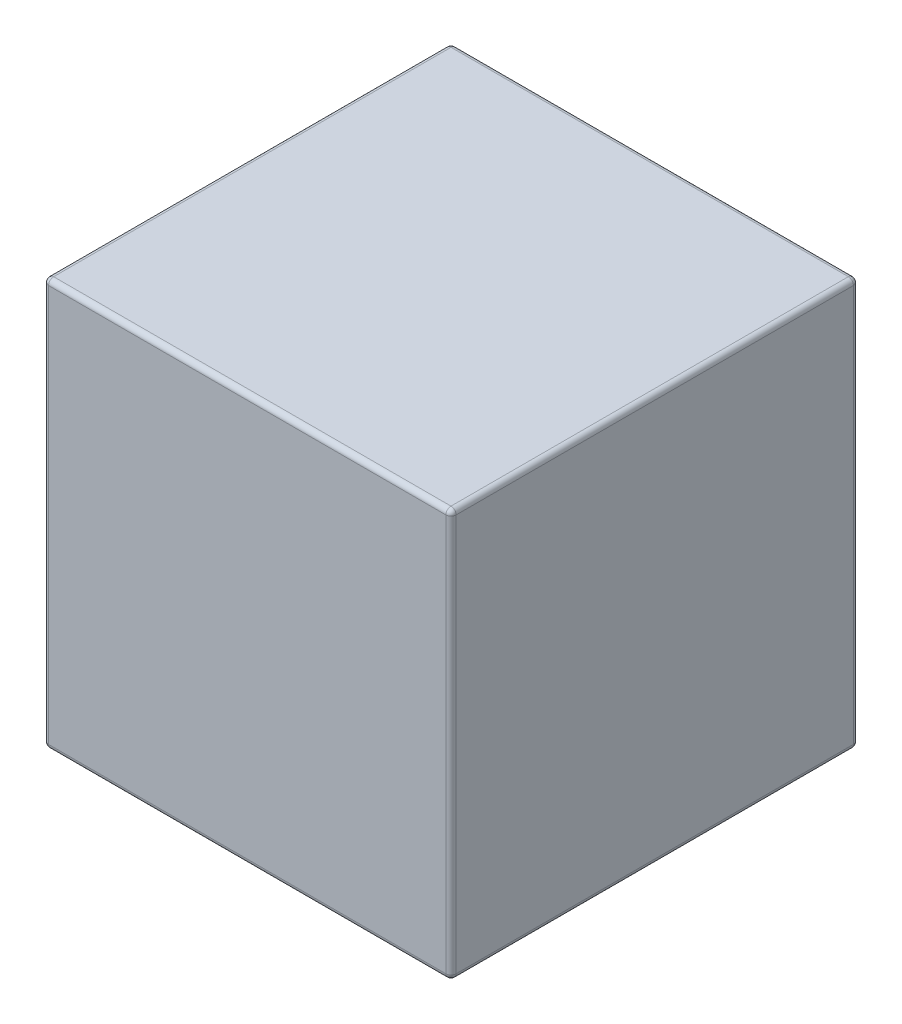
ISO-10303-21;
HEADER;
FILE_DESCRIPTION(('STEP AP214'),'2;1');
FILE_NAME('part.step','',(''),(''),'','','');
FILE_SCHEMA(('AUTOMOTIVE_DESIGN { 1 0 10303 214 1 1 1 1 }'));
ENDSEC;
DATA;
#1=APPLICATION_CONTEXT('core data for automotive mechanical design processes');
#2=APPLICATION_PROTOCOL_DEFINITION('international standard','automotive_design',2000,#1);
#3=PRODUCT_CONTEXT('',#1,'mechanical');
#4=PRODUCT('Part','Part','',(#3));
#5=PRODUCT_RELATED_PRODUCT_CATEGORY('part','',(#4));
#6=PRODUCT_DEFINITION_FORMATION('','',#4);
#7=PRODUCT_DEFINITION_CONTEXT('part definition',#1,'design');
#8=PRODUCT_DEFINITION('design','',#6,#7);
#9=PRODUCT_DEFINITION_SHAPE('','',#8);
#10=(LENGTH_UNIT() NAMED_UNIT(*) SI_UNIT(.MILLI.,.METRE.));
#11=(NAMED_UNIT(*) PLANE_ANGLE_UNIT() SI_UNIT($,.RADIAN.));
#12=(NAMED_UNIT(*) SI_UNIT($,.STERADIAN.) SOLID_ANGLE_UNIT());
#13=UNCERTAINTY_MEASURE_WITH_UNIT(LENGTH_MEASURE(1.E-05),#10,'distance_accuracy_value','');
#14=(GEOMETRIC_REPRESENTATION_CONTEXT(3) GLOBAL_UNCERTAINTY_ASSIGNED_CONTEXT((#13)) GLOBAL_UNIT_ASSIGNED_CONTEXT((#10,
#11,#12)) REPRESENTATION_CONTEXT('',''));
#15=CARTESIAN_POINT('',(0.,0.,0.));
#16=DIRECTION('',(0.,0.,1.));
#17=DIRECTION('',(1.,0.,0.));
#18=AXIS2_PLACEMENT_3D('',#15,#16,#17);
#19=CARTESIAN_POINT('',(25.4,50.8,25.4));
#20=DIRECTION('',(-1.,0.,0.));
#21=DIRECTION('',(0.,0.,1.));
#22=AXIS2_PLACEMENT_3D('',#19,#20,#21);
#23=PLANE('',#22);
#24=DIRECTION('',(0.,0.,-1.));
#25=VECTOR('',#24,1.);
#26=CARTESIAN_POINT('',(25.4,0.634999999999997,-25.4));
#27=LINE('',#26,#25);
#28=CARTESIAN_POINT('',(25.4,0.634999999999997,24.765));
#29=VERTEX_POINT('',#28);
#30=CARTESIAN_POINT('',(25.4,0.634999999999997,-24.765));
#31=VERTEX_POINT('',#30);
#32=EDGE_CURVE('E335',#29,#31,#27,.T.);
#33=ORIENTED_EDGE('',*,*,#32,.T.);
#34=DIRECTION('',(0.,-1.,0.));
#35=VECTOR('',#34,1.);
#36=CARTESIAN_POINT('',(25.4,50.8,-24.765));
#37=LINE('',#36,#35);
#38=CARTESIAN_POINT('',(25.4,50.165,-24.765));
#39=VERTEX_POINT('',#38);
#40=EDGE_CURVE('E255',#31,#39,#37,.F.);
#41=ORIENTED_EDGE('',*,*,#40,.T.);
#42=DIRECTION('',(0.,0.,-1.));
#43=VECTOR('',#42,1.);
#44=CARTESIAN_POINT('',(25.4,50.165,25.4));
#45=LINE('',#44,#43);
#46=CARTESIAN_POINT('',(25.4,50.165,24.765));
#47=VERTEX_POINT('',#46);
#48=EDGE_CURVE('E242',#39,#47,#45,.F.);
#49=ORIENTED_EDGE('',*,*,#48,.T.);
#50=DIRECTION('',(0.,-1.,0.));
#51=VECTOR('',#50,1.);
#52=CARTESIAN_POINT('',(25.4,50.8,24.765));
#53=LINE('',#52,#51);
#54=EDGE_CURVE('E330',#47,#29,#53,.T.);
#55=ORIENTED_EDGE('',*,*,#54,.T.);
#56=EDGE_LOOP('',(#33,#41,#49,#55));
#57=FACE_BOUND('',#56,.T.);
#58=ADVANCED_FACE('F44',(#57),#23,.F.);
#59=CARTESIAN_POINT('',(-25.4,50.8,-25.4));
#60=DIRECTION('',(0.,0.,1.));
#61=DIRECTION('',(1.,0.,0.));
#62=AXIS2_PLACEMENT_3D('',#59,#60,#61);
#63=PLANE('',#62);
#64=DIRECTION('',(-1.,0.,0.));
#65=VECTOR('',#64,1.);
#66=CARTESIAN_POINT('',(-25.4,0.634999999999997,-25.4));
#67=LINE('',#66,#65);
#68=CARTESIAN_POINT('',(24.765,0.634999999999997,-25.4));
#69=VERTEX_POINT('',#68);
#70=CARTESIAN_POINT('',(-24.765,0.634999999999997,-25.4));
#71=VERTEX_POINT('',#70);
#72=EDGE_CURVE('E308',#69,#71,#67,.T.);
#73=ORIENTED_EDGE('',*,*,#72,.T.);
#74=DIRECTION('',(0.,-1.,0.));
#75=VECTOR('',#74,1.);
#76=CARTESIAN_POINT('',(-24.765,50.8,-25.4));
#77=LINE('',#76,#75);
#78=CARTESIAN_POINT('',(-24.765,50.165,-25.4));
#79=VERTEX_POINT('',#78);
#80=EDGE_CURVE('E305',#71,#79,#77,.F.);
#81=ORIENTED_EDGE('',*,*,#80,.T.);
#82=DIRECTION('',(-1.,0.,0.));
#83=VECTOR('',#82,1.);
#84=CARTESIAN_POINT('',(-25.4,50.165,-25.4));
#85=LINE('',#84,#83);
#86=CARTESIAN_POINT('',(24.765,50.165,-25.4));
#87=VERTEX_POINT('',#86);
#88=EDGE_CURVE('E296',#79,#87,#85,.F.);
#89=ORIENTED_EDGE('',*,*,#88,.T.);
#90=DIRECTION('',(0.,-1.,0.));
#91=VECTOR('',#90,1.);
#92=CARTESIAN_POINT('',(24.765,50.8,-25.4));
#93=LINE('',#92,#91);
#94=EDGE_CURVE('E302',#87,#69,#93,.T.);
#95=ORIENTED_EDGE('',*,*,#94,.T.);
#96=EDGE_LOOP('',(#73,#81,#89,#95));
#97=FACE_BOUND('',#96,.T.);
#98=ADVANCED_FACE('F306',(#97),#63,.F.);
#99=CARTESIAN_POINT('',(-25.4,50.8,25.4));
#100=DIRECTION('',(1.,0.,0.));
#101=DIRECTION('',(0.,0.,-1.));
#102=AXIS2_PLACEMENT_3D('',#99,#100,#101);
#103=PLANE('',#102);
#104=DIRECTION('',(0.,0.,1.));
#105=VECTOR('',#104,1.);
#106=CARTESIAN_POINT('',(-25.4,50.165,25.4));
#107=LINE('',#106,#105);
#108=CARTESIAN_POINT('',(-25.4,50.165,24.765));
#109=VERTEX_POINT('',#108);
#110=CARTESIAN_POINT('',(-25.4,50.165,-24.765));
#111=VERTEX_POINT('',#110);
#112=EDGE_CURVE('E145',#109,#111,#107,.F.);
#113=ORIENTED_EDGE('',*,*,#112,.T.);
#114=DIRECTION('',(0.,-1.,0.));
#115=VECTOR('',#114,1.);
#116=CARTESIAN_POINT('',(-25.4,50.8,-24.765));
#117=LINE('',#116,#115);
#118=CARTESIAN_POINT('',(-25.4,0.634999999999997,-24.765));
#119=VERTEX_POINT('',#118);
#120=EDGE_CURVE('E140',#111,#119,#117,.T.);
#121=ORIENTED_EDGE('',*,*,#120,.T.);
#122=DIRECTION('',(0.,0.,1.));
#123=VECTOR('',#122,1.);
#124=CARTESIAN_POINT('',(-25.4,0.634999999999997,25.4));
#125=LINE('',#124,#123);
#126=CARTESIAN_POINT('',(-25.4,0.634999999999997,24.765));
#127=VERTEX_POINT('',#126);
#128=EDGE_CURVE('E134',#119,#127,#125,.T.);
#129=ORIENTED_EDGE('',*,*,#128,.T.);
#130=DIRECTION('',(0.,-1.,0.));
#131=VECTOR('',#130,1.);
#132=CARTESIAN_POINT('',(-25.4,50.8,24.765));
#133=LINE('',#132,#131);
#134=EDGE_CURVE('E137',#127,#109,#133,.F.);
#135=ORIENTED_EDGE('',*,*,#134,.T.);
#136=EDGE_LOOP('',(#113,#121,#129,#135));
#137=FACE_BOUND('',#136,.T.);
#138=ADVANCED_FACE('F136',(#137),#103,.F.);
#139=CARTESIAN_POINT('',(-25.4,50.8,25.4));
#140=DIRECTION('',(0.,0.,-1.));
#141=DIRECTION('',(-1.,0.,0.));
#142=AXIS2_PLACEMENT_3D('',#139,#140,#141);
#143=PLANE('',#142);
#144=DIRECTION('',(1.,0.,0.));
#145=VECTOR('',#144,1.);
#146=CARTESIAN_POINT('',(-25.4,50.165,25.4));
#147=LINE('',#146,#145);
#148=CARTESIAN_POINT('',(24.765,50.165,25.4));
#149=VERTEX_POINT('',#148);
#150=CARTESIAN_POINT('',(-24.765,50.165,25.4));
#151=VERTEX_POINT('',#150);
#152=EDGE_CURVE('E54',#149,#151,#147,.F.);
#153=ORIENTED_EDGE('',*,*,#152,.T.);
#154=DIRECTION('',(0.,-1.,0.));
#155=VECTOR('',#154,1.);
#156=CARTESIAN_POINT('',(-24.765,50.8,25.4));
#157=LINE('',#156,#155);
#158=CARTESIAN_POINT('',(-24.765,0.634999999999997,25.4));
#159=VERTEX_POINT('',#158);
#160=EDGE_CURVE('E11',#151,#159,#157,.T.);
#161=ORIENTED_EDGE('',*,*,#160,.T.);
#162=DIRECTION('',(1.,0.,0.));
#163=VECTOR('',#162,1.);
#164=CARTESIAN_POINT('',(25.4,0.634999999999997,25.4));
#165=LINE('',#164,#163);
#166=CARTESIAN_POINT('',(24.765,0.634999999999997,25.4));
#167=VERTEX_POINT('',#166);
#168=EDGE_CURVE('E262',#159,#167,#165,.T.);
#169=ORIENTED_EDGE('',*,*,#168,.T.);
#170=DIRECTION('',(0.,-1.,0.));
#171=VECTOR('',#170,1.);
#172=CARTESIAN_POINT('',(24.765,50.8,25.4));
#173=LINE('',#172,#171);
#174=EDGE_CURVE('E65',#167,#149,#173,.F.);
#175=ORIENTED_EDGE('',*,*,#174,.T.);
#176=EDGE_LOOP('',(#153,#161,#169,#175));
#177=FACE_BOUND('',#176,.T.);
#178=ADVANCED_FACE('F441',(#177),#143,.F.);
#179=CARTESIAN_POINT('',(0.,50.8,0.));
#180=DIRECTION('',(0.,-1.,0.));
#181=DIRECTION('',(0.,0.,-1.));
#182=AXIS2_PLACEMENT_3D('',#179,#180,#181);
#183=PLANE('',#182);
#184=DIRECTION('',(-1.,0.,0.));
#185=VECTOR('',#184,1.);
#186=CARTESIAN_POINT('',(0.,50.8,-24.765));
#187=LINE('',#186,#185);
#188=CARTESIAN_POINT('',(24.765,50.8,-24.765));
#189=VERTEX_POINT('',#188);
#190=CARTESIAN_POINT('',(-24.765,50.8,-24.765));
#191=VERTEX_POINT('',#190);
#192=EDGE_CURVE('E248',#189,#191,#187,.T.);
#193=ORIENTED_EDGE('',*,*,#192,.T.);
#194=DIRECTION('',(0.,0.,1.));
#195=VECTOR('',#194,1.);
#196=CARTESIAN_POINT('',(-24.765,50.8,0.));
#197=LINE('',#196,#195);
#198=CARTESIAN_POINT('',(-24.765,50.8,24.765));
#199=VERTEX_POINT('',#198);
#200=EDGE_CURVE('E253',#191,#199,#197,.T.);
#201=ORIENTED_EDGE('',*,*,#200,.T.);
#202=DIRECTION('',(1.,0.,0.));
#203=VECTOR('',#202,1.);
#204=CARTESIAN_POINT('',(0.,50.8,24.765));
#205=LINE('',#204,#203);
#206=CARTESIAN_POINT('',(24.765,50.8,24.765));
#207=VERTEX_POINT('',#206);
#208=EDGE_CURVE('E249',#199,#207,#205,.T.);
#209=ORIENTED_EDGE('',*,*,#208,.T.);
#210=DIRECTION('',(0.,0.,-1.));
#211=VECTOR('',#210,1.);
#212=CARTESIAN_POINT('',(24.765,50.8,0.));
#213=LINE('',#212,#211);
#214=EDGE_CURVE('E244',#207,#189,#213,.T.);
#215=ORIENTED_EDGE('',*,*,#214,.T.);
#216=EDGE_LOOP('',(#193,#201,#209,#215));
#217=FACE_BOUND('',#216,.T.);
#218=ADVANCED_FACE('F365',(#217),#183,.F.);
#219=CARTESIAN_POINT('',(0.,0.,0.));
#220=DIRECTION('',(0.,-1.,0.));
#221=DIRECTION('',(0.,0.,-1.));
#222=AXIS2_PLACEMENT_3D('',#219,#220,#221);
#223=PLANE('',#222);
#224=DIRECTION('',(0.,0.,1.));
#225=VECTOR('',#224,1.);
#226=CARTESIAN_POINT('',(-24.765,0.,-25.4));
#227=LINE('',#226,#225);
#228=CARTESIAN_POINT('',(-24.765,0.,24.765));
#229=VERTEX_POINT('',#228);
#230=CARTESIAN_POINT('',(-24.765,0.,-24.765));
#231=VERTEX_POINT('',#230);
#232=EDGE_CURVE('E168',#229,#231,#227,.F.);
#233=ORIENTED_EDGE('',*,*,#232,.T.);
#234=DIRECTION('',(-1.,0.,0.));
#235=VECTOR('',#234,1.);
#236=CARTESIAN_POINT('',(25.4,0.,-24.765));
#237=LINE('',#236,#235);
#238=CARTESIAN_POINT('',(24.765,0.,-24.765));
#239=VERTEX_POINT('',#238);
#240=EDGE_CURVE('E326',#231,#239,#237,.F.);
#241=ORIENTED_EDGE('',*,*,#240,.T.);
#242=DIRECTION('',(0.,0.,-1.));
#243=VECTOR('',#242,1.);
#244=CARTESIAN_POINT('',(24.765,0.,25.4));
#245=LINE('',#244,#243);
#246=CARTESIAN_POINT('',(24.765,0.,24.765));
#247=VERTEX_POINT('',#246);
#248=EDGE_CURVE('E317',#239,#247,#245,.F.);
#249=ORIENTED_EDGE('',*,*,#248,.T.);
#250=DIRECTION('',(1.,0.,0.));
#251=VECTOR('',#250,1.);
#252=CARTESIAN_POINT('',(-25.4,0.,24.765));
#253=LINE('',#252,#251);
#254=EDGE_CURVE('E313',#247,#229,#253,.F.);
#255=ORIENTED_EDGE('',*,*,#254,.T.);
#256=EDGE_LOOP('',(#233,#241,#249,#255));
#257=FACE_BOUND('',#256,.T.);
#258=ADVANCED_FACE('F432',(#257),#223,.T.);
#259=CARTESIAN_POINT('',(24.765,50.8,24.765));
#260=DIRECTION('',(0.,-1.,0.));
#261=DIRECTION('',(0.,0.,-1.));
#262=AXIS2_PLACEMENT_3D('',#259,#260,#261);
#263=CYLINDRICAL_SURFACE('',#262,0.635);
#264=CARTESIAN_POINT('',(24.765,50.165,24.765));
#265=DIRECTION('',(0.,1.,0.));
#266=DIRECTION('',(0.,0.,1.));
#267=AXIS2_PLACEMENT_3D('',#264,#265,#266);
#268=CIRCLE('',#267,0.635);
#269=EDGE_CURVE('E48',#149,#47,#268,.T.);
#270=ORIENTED_EDGE('',*,*,#269,.F.);
#271=ORIENTED_EDGE('',*,*,#174,.F.);
#272=CARTESIAN_POINT('',(24.765,0.634999999999997,24.765));
#273=DIRECTION('',(0.,-1.,0.));
#274=DIRECTION('',(0.,0.,-1.));
#275=AXIS2_PLACEMENT_3D('',#272,#273,#274);
#276=CIRCLE('',#275,0.635);
#277=EDGE_CURVE('E222',#29,#167,#276,.T.);
#278=ORIENTED_EDGE('',*,*,#277,.F.);
#279=ORIENTED_EDGE('',*,*,#54,.F.);
#280=EDGE_LOOP('',(#270,#271,#278,#279));
#281=FACE_BOUND('',#280,.T.);
#282=ADVANCED_FACE('F46',(#281),#263,.T.);
#283=CARTESIAN_POINT('',(24.765,50.165,24.765));
#284=DIRECTION('',(1.,0.,0.));
#285=DIRECTION('',(0.,0.,-1.));
#286=AXIS2_PLACEMENT_3D('',#283,#284,#285);
#287=SPHERICAL_SURFACE('',#286,0.635);
#288=CARTESIAN_POINT('',(24.765,50.165,24.765));
#289=DIRECTION('',(1.,0.,0.));
#290=DIRECTION('',(0.,0.,-1.));
#291=AXIS2_PLACEMENT_3D('',#288,#289,#290);
#292=CIRCLE('',#291,0.635);
#293=EDGE_CURVE('E215',#149,#207,#292,.F.);
#294=ORIENTED_EDGE('',*,*,#293,.F.);
#295=ORIENTED_EDGE('',*,*,#269,.T.);
#296=CARTESIAN_POINT('',(24.765,50.165,24.765));
#297=DIRECTION('',(0.,0.,1.));
#298=DIRECTION('',(1.,0.,0.));
#299=AXIS2_PLACEMENT_3D('',#296,#297,#298);
#300=CIRCLE('',#299,0.635);
#301=EDGE_CURVE('E219',#207,#47,#300,.F.);
#302=ORIENTED_EDGE('',*,*,#301,.F.);
#303=EDGE_LOOP('',(#294,#295,#302));
#304=FACE_BOUND('',#303,.T.);
#305=ADVANCED_FACE('F234',(#304),#287,.T.);
#306=CARTESIAN_POINT('',(24.765,0.635,24.765));
#307=DIRECTION('',(0.,0.,1.));
#308=DIRECTION('',(0.,-1.,0.));
#309=AXIS2_PLACEMENT_3D('',#306,#307,#308);
#310=SPHERICAL_SURFACE('',#309,0.635);
#311=CARTESIAN_POINT('',(24.765,0.635,24.765));
#312=DIRECTION('',(0.,0.,1.));
#313=DIRECTION('',(1.,0.,0.));
#314=AXIS2_PLACEMENT_3D('',#311,#312,#313);
#315=CIRCLE('',#314,0.635);
#316=EDGE_CURVE('E207',#29,#247,#315,.F.);
#317=ORIENTED_EDGE('',*,*,#316,.F.);
#318=ORIENTED_EDGE('',*,*,#277,.T.);
#319=CARTESIAN_POINT('',(24.765,0.634999999999997,24.765));
#320=DIRECTION('',(1.,0.,0.));
#321=DIRECTION('',(0.,0.,-1.));
#322=AXIS2_PLACEMENT_3D('',#319,#320,#321);
#323=CIRCLE('',#322,0.635);
#324=EDGE_CURVE('E211',#247,#167,#323,.F.);
#325=ORIENTED_EDGE('',*,*,#324,.F.);
#326=EDGE_LOOP('',(#317,#318,#325));
#327=FACE_BOUND('',#326,.T.);
#328=ADVANCED_FACE('F383',(#327),#310,.T.);
#329=CARTESIAN_POINT('',(24.765,50.165,0.));
#330=DIRECTION('',(0.,0.,-1.));
#331=DIRECTION('',(-1.,0.,0.));
#332=AXIS2_PLACEMENT_3D('',#329,#330,#331);
#333=CYLINDRICAL_SURFACE('',#332,0.635);
#334=ORIENTED_EDGE('',*,*,#301,.T.);
#335=ORIENTED_EDGE('',*,*,#48,.F.);
#336=CARTESIAN_POINT('',(24.765,50.165,-24.765));
#337=DIRECTION('',(0.,0.,-1.));
#338=DIRECTION('',(-1.,0.,0.));
#339=AXIS2_PLACEMENT_3D('',#336,#337,#338);
#340=CIRCLE('',#339,0.635);
#341=EDGE_CURVE('E200',#189,#39,#340,.T.);
#342=ORIENTED_EDGE('',*,*,#341,.F.);
#343=ORIENTED_EDGE('',*,*,#214,.F.);
#344=EDGE_LOOP('',(#334,#335,#342,#343));
#345=FACE_BOUND('',#344,.T.);
#346=ADVANCED_FACE('F240',(#345),#333,.T.);
#347=CARTESIAN_POINT('',(0.,50.165,24.765));
#348=DIRECTION('',(1.,0.,0.));
#349=DIRECTION('',(0.,0.,-1.));
#350=AXIS2_PLACEMENT_3D('',#347,#348,#349);
#351=CYLINDRICAL_SURFACE('',#350,0.635);
#352=ORIENTED_EDGE('',*,*,#293,.T.);
#353=ORIENTED_EDGE('',*,*,#208,.F.);
#354=CARTESIAN_POINT('',(-24.765,50.165,24.765));
#355=DIRECTION('',(-1.,0.,0.));
#356=DIRECTION('',(0.,0.,1.));
#357=AXIS2_PLACEMENT_3D('',#354,#355,#356);
#358=CIRCLE('',#357,0.635);
#359=EDGE_CURVE('E196',#151,#199,#358,.T.);
#360=ORIENTED_EDGE('',*,*,#359,.F.);
#361=ORIENTED_EDGE('',*,*,#152,.F.);
#362=EDGE_LOOP('',(#352,#353,#360,#361));
#363=FACE_BOUND('',#362,.T.);
#364=ADVANCED_FACE('F374',(#363),#351,.T.);
#365=CARTESIAN_POINT('',(-24.765,50.8,24.765));
#366=DIRECTION('',(0.,-1.,0.));
#367=DIRECTION('',(0.,0.,-1.));
#368=AXIS2_PLACEMENT_3D('',#365,#366,#367);
#369=CYLINDRICAL_SURFACE('',#368,0.635);
#370=CARTESIAN_POINT('',(-24.765,0.634999999999997,24.765));
#371=DIRECTION('',(0.,-1.,0.));
#372=DIRECTION('',(0.,0.,-1.));
#373=AXIS2_PLACEMENT_3D('',#370,#371,#372);
#374=CIRCLE('',#373,0.635);
#375=EDGE_CURVE('E151',#159,#127,#374,.T.);
#376=ORIENTED_EDGE('',*,*,#375,.F.);
#377=ORIENTED_EDGE('',*,*,#160,.F.);
#378=CARTESIAN_POINT('',(-24.765,50.165,24.765));
#379=DIRECTION('',(0.,1.,0.));
#380=DIRECTION('',(0.,0.,1.));
#381=AXIS2_PLACEMENT_3D('',#378,#379,#380);
#382=CIRCLE('',#381,0.635);
#383=EDGE_CURVE('E154',#109,#151,#382,.T.);
#384=ORIENTED_EDGE('',*,*,#383,.F.);
#385=ORIENTED_EDGE('',*,*,#134,.F.);
#386=EDGE_LOOP('',(#376,#377,#384,#385));
#387=FACE_BOUND('',#386,.T.);
#388=ADVANCED_FACE('F150',(#387),#369,.T.);
#389=CARTESIAN_POINT('',(-25.4,0.634999999999997,24.765));
#390=DIRECTION('',(-1.,0.,0.));
#391=DIRECTION('',(0.,0.,1.));
#392=AXIS2_PLACEMENT_3D('',#389,#390,#391);
#393=CYLINDRICAL_SURFACE('',#392,0.635);
#394=ORIENTED_EDGE('',*,*,#324,.T.);
#395=ORIENTED_EDGE('',*,*,#168,.F.);
#396=CARTESIAN_POINT('',(-24.765,0.635,24.765));
#397=DIRECTION('',(-1.,0.,0.));
#398=DIRECTION('',(0.,0.,1.));
#399=AXIS2_PLACEMENT_3D('',#396,#397,#398);
#400=CIRCLE('',#399,0.635);
#401=EDGE_CURVE('E164',#229,#159,#400,.T.);
#402=ORIENTED_EDGE('',*,*,#401,.F.);
#403=ORIENTED_EDGE('',*,*,#254,.F.);
#404=EDGE_LOOP('',(#394,#395,#402,#403));
#405=FACE_BOUND('',#404,.T.);
#406=ADVANCED_FACE('F381',(#405),#393,.T.);
#407=CARTESIAN_POINT('',(24.765,0.634999999999997,25.4));
#408=DIRECTION('',(0.,0.,1.));
#409=DIRECTION('',(1.,0.,0.));
#410=AXIS2_PLACEMENT_3D('',#407,#408,#409);
#411=CYLINDRICAL_SURFACE('',#410,0.635);
#412=ORIENTED_EDGE('',*,*,#316,.T.);
#413=ORIENTED_EDGE('',*,*,#248,.F.);
#414=CARTESIAN_POINT('',(24.765,0.634999999999997,-24.765));
#415=DIRECTION('',(0.,0.,-1.));
#416=DIRECTION('',(-1.,0.,0.));
#417=AXIS2_PLACEMENT_3D('',#414,#415,#416);
#418=CIRCLE('',#417,0.635);
#419=EDGE_CURVE('E188',#31,#239,#418,.T.);
#420=ORIENTED_EDGE('',*,*,#419,.F.);
#421=ORIENTED_EDGE('',*,*,#32,.F.);
#422=EDGE_LOOP('',(#412,#413,#420,#421));
#423=FACE_BOUND('',#422,.T.);
#424=ADVANCED_FACE('F349',(#423),#411,.T.);
#425=CARTESIAN_POINT('',(24.765,50.8,-24.765));
#426=DIRECTION('',(0.,-1.,0.));
#427=DIRECTION('',(0.,0.,-1.));
#428=AXIS2_PLACEMENT_3D('',#425,#426,#427);
#429=CYLINDRICAL_SURFACE('',#428,0.635);
#430=CARTESIAN_POINT('',(24.765,50.165,-24.765));
#431=DIRECTION('',(0.,1.,0.));
#432=DIRECTION('',(0.,0.,1.));
#433=AXIS2_PLACEMENT_3D('',#430,#431,#432);
#434=CIRCLE('',#433,0.635);
#435=EDGE_CURVE('E203',#39,#87,#434,.T.);
#436=ORIENTED_EDGE('',*,*,#435,.F.);
#437=ORIENTED_EDGE('',*,*,#40,.F.);
#438=CARTESIAN_POINT('',(24.765,0.634999999999997,-24.765));
#439=DIRECTION('',(0.,-1.,0.));
#440=DIRECTION('',(0.,0.,-1.));
#441=AXIS2_PLACEMENT_3D('',#438,#439,#440);
#442=CIRCLE('',#441,0.635);
#443=EDGE_CURVE('E184',#69,#31,#442,.T.);
#444=ORIENTED_EDGE('',*,*,#443,.F.);
#445=ORIENTED_EDGE('',*,*,#94,.F.);
#446=EDGE_LOOP('',(#436,#437,#444,#445));
#447=FACE_BOUND('',#446,.T.);
#448=ADVANCED_FACE('F345',(#447),#429,.T.);
#449=CARTESIAN_POINT('',(24.765,50.165,-24.765));
#450=DIRECTION('',(1.,0.,0.));
#451=DIRECTION('',(0.,0.,-1.));
#452=AXIS2_PLACEMENT_3D('',#449,#450,#451);
#453=SPHERICAL_SURFACE('',#452,0.635);
#454=ORIENTED_EDGE('',*,*,#341,.T.);
#455=ORIENTED_EDGE('',*,*,#435,.T.);
#456=CARTESIAN_POINT('',(24.765,50.165,-24.765));
#457=DIRECTION('',(1.,0.,0.));
#458=DIRECTION('',(0.,1.,0.));
#459=AXIS2_PLACEMENT_3D('',#456,#457,#458);
#460=CIRCLE('',#459,0.635);
#461=EDGE_CURVE('E175',#189,#87,#460,.F.);
#462=ORIENTED_EDGE('',*,*,#461,.F.);
#463=EDGE_LOOP('',(#454,#455,#462));
#464=FACE_BOUND('',#463,.T.);
#465=ADVANCED_FACE('F363',(#464),#453,.T.);
#466=CARTESIAN_POINT('',(-24.765,50.165,24.765));
#467=DIRECTION('',(0.,0.,1.));
#468=DIRECTION('',(1.,0.,0.));
#469=AXIS2_PLACEMENT_3D('',#466,#467,#468);
#470=SPHERICAL_SURFACE('',#469,0.635);
#471=ORIENTED_EDGE('',*,*,#383,.T.);
#472=ORIENTED_EDGE('',*,*,#359,.T.);
#473=CARTESIAN_POINT('',(-24.765,50.165,24.765));
#474=DIRECTION('',(0.,0.,1.));
#475=DIRECTION('',(1.,0.,0.));
#476=AXIS2_PLACEMENT_3D('',#473,#474,#475);
#477=CIRCLE('',#476,0.635);
#478=EDGE_CURVE('E170',#109,#199,#477,.F.);
#479=ORIENTED_EDGE('',*,*,#478,.F.);
#480=EDGE_LOOP('',(#471,#472,#479));
#481=FACE_BOUND('',#480,.T.);
#482=ADVANCED_FACE('F372',(#481),#470,.T.);
#483=CARTESIAN_POINT('',(-24.765,0.635,24.765));
#484=DIRECTION('',(0.,0.,1.));
#485=DIRECTION('',(0.,-1.,0.));
#486=AXIS2_PLACEMENT_3D('',#483,#484,#485);
#487=SPHERICAL_SURFACE('',#486,0.635);
#488=ORIENTED_EDGE('',*,*,#401,.T.);
#489=ORIENTED_EDGE('',*,*,#375,.T.);
#490=CARTESIAN_POINT('',(-24.765,0.634999999999997,24.765));
#491=DIRECTION('',(0.,0.,1.));
#492=DIRECTION('',(1.,0.,0.));
#493=AXIS2_PLACEMENT_3D('',#490,#491,#492);
#494=CIRCLE('',#493,0.635);
#495=EDGE_CURVE('E161',#229,#127,#494,.F.);
#496=ORIENTED_EDGE('',*,*,#495,.F.);
#497=EDGE_LOOP('',(#488,#489,#496));
#498=FACE_BOUND('',#497,.T.);
#499=ADVANCED_FACE('F160',(#498),#487,.T.);
#500=CARTESIAN_POINT('',(24.765,0.635,-24.765));
#501=DIRECTION('',(1.,0.,0.));
#502=DIRECTION('',(0.,1.,0.));
#503=AXIS2_PLACEMENT_3D('',#500,#501,#502);
#504=SPHERICAL_SURFACE('',#503,0.635);
#505=ORIENTED_EDGE('',*,*,#443,.T.);
#506=ORIENTED_EDGE('',*,*,#419,.T.);
#507=CARTESIAN_POINT('',(24.765,0.635,-24.765));
#508=DIRECTION('',(1.,0.,0.));
#509=DIRECTION('',(0.,0.,-1.));
#510=AXIS2_PLACEMENT_3D('',#507,#508,#509);
#511=CIRCLE('',#510,0.635);
#512=EDGE_CURVE('E171',#69,#239,#511,.F.);
#513=ORIENTED_EDGE('',*,*,#512,.F.);
#514=EDGE_LOOP('',(#505,#506,#513));
#515=FACE_BOUND('',#514,.T.);
#516=ADVANCED_FACE('F351',(#515),#504,.T.);
#517=CARTESIAN_POINT('',(0.,50.165,-24.765));
#518=DIRECTION('',(-1.,0.,0.));
#519=DIRECTION('',(0.,0.,1.));
#520=AXIS2_PLACEMENT_3D('',#517,#518,#519);
#521=CYLINDRICAL_SURFACE('',#520,0.635);
#522=ORIENTED_EDGE('',*,*,#461,.T.);
#523=ORIENTED_EDGE('',*,*,#88,.F.);
#524=CARTESIAN_POINT('',(-24.765,50.165,-24.765));
#525=DIRECTION('',(-1.,0.,0.));
#526=DIRECTION('',(0.,0.,1.));
#527=AXIS2_PLACEMENT_3D('',#524,#525,#526);
#528=CIRCLE('',#527,0.635);
#529=EDGE_CURVE('E177',#191,#79,#528,.T.);
#530=ORIENTED_EDGE('',*,*,#529,.F.);
#531=ORIENTED_EDGE('',*,*,#192,.F.);
#532=EDGE_LOOP('',(#522,#523,#530,#531));
#533=FACE_BOUND('',#532,.T.);
#534=ADVANCED_FACE('F298',(#533),#521,.T.);
#535=CARTESIAN_POINT('',(-24.765,50.165,0.));
#536=DIRECTION('',(0.,0.,1.));
#537=DIRECTION('',(1.,0.,0.));
#538=AXIS2_PLACEMENT_3D('',#535,#536,#537);
#539=CYLINDRICAL_SURFACE('',#538,0.635);
#540=ORIENTED_EDGE('',*,*,#478,.T.);
#541=ORIENTED_EDGE('',*,*,#200,.F.);
#542=CARTESIAN_POINT('',(-24.765,50.165,-24.765));
#543=DIRECTION('',(0.,0.,-1.));
#544=DIRECTION('',(0.,1.,0.));
#545=AXIS2_PLACEMENT_3D('',#542,#543,#544);
#546=CIRCLE('',#545,0.635);
#547=EDGE_CURVE('E283',#111,#191,#546,.T.);
#548=ORIENTED_EDGE('',*,*,#547,.F.);
#549=ORIENTED_EDGE('',*,*,#112,.F.);
#550=EDGE_LOOP('',(#540,#541,#548,#549));
#551=FACE_BOUND('',#550,.T.);
#552=ADVANCED_FACE('F367',(#551),#539,.T.);
#553=CARTESIAN_POINT('',(-24.765,0.634999999999997,25.4));
#554=DIRECTION('',(0.,0.,-1.));
#555=DIRECTION('',(-1.,0.,0.));
#556=AXIS2_PLACEMENT_3D('',#553,#554,#555);
#557=CYLINDRICAL_SURFACE('',#556,0.635);
#558=ORIENTED_EDGE('',*,*,#495,.T.);
#559=ORIENTED_EDGE('',*,*,#128,.F.);
#560=CARTESIAN_POINT('',(-24.765,0.635,-24.765));
#561=DIRECTION('',(0.,0.,-1.));
#562=DIRECTION('',(-1.,0.,0.));
#563=AXIS2_PLACEMENT_3D('',#560,#561,#562);
#564=CIRCLE('',#563,0.635);
#565=EDGE_CURVE('E279',#231,#119,#564,.T.);
#566=ORIENTED_EDGE('',*,*,#565,.F.);
#567=ORIENTED_EDGE('',*,*,#232,.F.);
#568=EDGE_LOOP('',(#558,#559,#566,#567));
#569=FACE_BOUND('',#568,.T.);
#570=ADVANCED_FACE('F167',(#569),#557,.T.);
#571=CARTESIAN_POINT('',(-25.4,0.634999999999997,-24.765));
#572=DIRECTION('',(1.,0.,0.));
#573=DIRECTION('',(0.,0.,-1.));
#574=AXIS2_PLACEMENT_3D('',#571,#572,#573);
#575=CYLINDRICAL_SURFACE('',#574,0.635);
#576=ORIENTED_EDGE('',*,*,#512,.T.);
#577=ORIENTED_EDGE('',*,*,#240,.F.);
#578=CARTESIAN_POINT('',(-24.765,0.634999999999997,-24.765));
#579=DIRECTION('',(-1.,0.,0.));
#580=DIRECTION('',(0.,0.,1.));
#581=AXIS2_PLACEMENT_3D('',#578,#579,#580);
#582=CIRCLE('',#581,0.635);
#583=EDGE_CURVE('E275',#71,#231,#582,.T.);
#584=ORIENTED_EDGE('',*,*,#583,.F.);
#585=ORIENTED_EDGE('',*,*,#72,.F.);
#586=EDGE_LOOP('',(#576,#577,#584,#585));
#587=FACE_BOUND('',#586,.T.);
#588=ADVANCED_FACE('F354',(#587),#575,.T.);
#589=CARTESIAN_POINT('',(-24.765,50.165,-24.765));
#590=DIRECTION('',(0.,1.,0.));
#591=DIRECTION('',(0.,0.,1.));
#592=AXIS2_PLACEMENT_3D('',#589,#590,#591);
#593=SPHERICAL_SURFACE('',#592,0.635);
#594=ORIENTED_EDGE('',*,*,#547,.T.);
#595=ORIENTED_EDGE('',*,*,#529,.T.);
#596=CARTESIAN_POINT('',(-24.765,50.165,-24.765));
#597=DIRECTION('',(0.,1.,0.));
#598=DIRECTION('',(0.,0.,1.));
#599=AXIS2_PLACEMENT_3D('',#596,#597,#598);
#600=CIRCLE('',#599,0.635);
#601=EDGE_CURVE('E272',#111,#79,#600,.F.);
#602=ORIENTED_EDGE('',*,*,#601,.F.);
#603=EDGE_LOOP('',(#594,#595,#602));
#604=FACE_BOUND('',#603,.T.);
#605=ADVANCED_FACE('F292',(#604),#593,.T.);
#606=CARTESIAN_POINT('',(-24.765,0.635,-24.765));
#607=DIRECTION('',(0.,-1.,0.));
#608=DIRECTION('',(0.,0.,-1.));
#609=AXIS2_PLACEMENT_3D('',#606,#607,#608);
#610=SPHERICAL_SURFACE('',#609,0.635);
#611=ORIENTED_EDGE('',*,*,#583,.T.);
#612=ORIENTED_EDGE('',*,*,#565,.T.);
#613=CARTESIAN_POINT('',(-24.765,0.634999999999997,-24.765));
#614=DIRECTION('',(0.,-1.,0.));
#615=DIRECTION('',(0.,0.,-1.));
#616=AXIS2_PLACEMENT_3D('',#613,#614,#615);
#617=CIRCLE('',#616,0.635);
#618=EDGE_CURVE('E269',#71,#119,#617,.F.);
#619=ORIENTED_EDGE('',*,*,#618,.F.);
#620=EDGE_LOOP('',(#611,#612,#619));
#621=FACE_BOUND('',#620,.T.);
#622=ADVANCED_FACE('F356',(#621),#610,.T.);
#623=CARTESIAN_POINT('',(-24.765,50.8,-24.765));
#624=DIRECTION('',(0.,-1.,0.));
#625=DIRECTION('',(0.,0.,-1.));
#626=AXIS2_PLACEMENT_3D('',#623,#624,#625);
#627=CYLINDRICAL_SURFACE('',#626,0.635);
#628=ORIENTED_EDGE('',*,*,#601,.T.);
#629=ORIENTED_EDGE('',*,*,#80,.F.);
#630=ORIENTED_EDGE('',*,*,#618,.T.);
#631=ORIENTED_EDGE('',*,*,#120,.F.);
#632=EDGE_LOOP('',(#628,#629,#630,#631));
#633=FACE_BOUND('',#632,.T.);
#634=ADVANCED_FACE('F357',(#633),#627,.T.);
#635=CLOSED_SHELL('',(#58,#98,#138,#178,#218,#258,#282,#305,#328,#346,#364,#388,#406,#424,#448,
#465,#482,#499,#516,#534,#552,#570,#588,#605,#622,#634));
#636=MANIFOLD_SOLID_BREP('B2',#635);
#637=ADVANCED_BREP_SHAPE_REPRESENTATION('',(#18,#636),#14);
#638=SHAPE_DEFINITION_REPRESENTATION(#9,#637);
ENDSEC;
END-ISO-10303-21;
